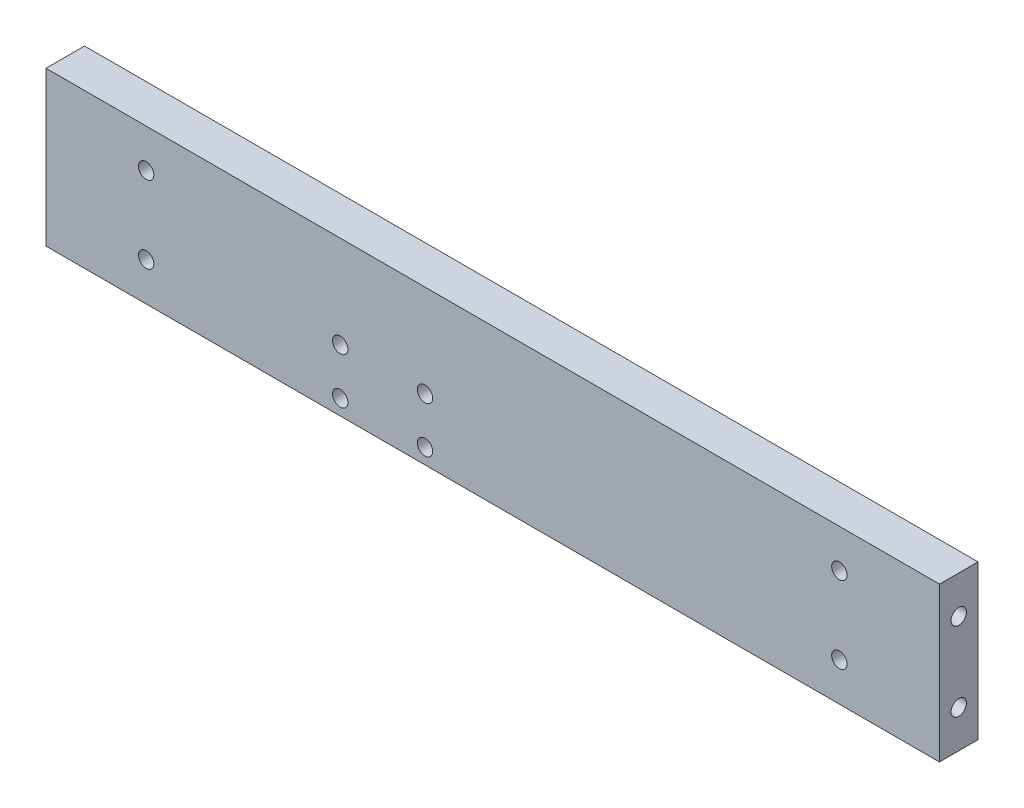
ISO-10303-21;
HEADER;
FILE_DESCRIPTION(('STEP AP214'),'2;1');
FILE_NAME('part.step','',(''),(''),'','','');
FILE_SCHEMA(('AUTOMOTIVE_DESIGN { 1 0 10303 214 1 1 1 1 }'));
ENDSEC;
DATA;
#1=APPLICATION_CONTEXT('core data for automotive mechanical design processes');
#2=APPLICATION_PROTOCOL_DEFINITION('international standard','automotive_design',2000,#1);
#3=PRODUCT_CONTEXT('',#1,'mechanical');
#4=PRODUCT('Part','Part','',(#3));
#5=PRODUCT_RELATED_PRODUCT_CATEGORY('part','',(#4));
#6=PRODUCT_DEFINITION_FORMATION('','',#4);
#7=PRODUCT_DEFINITION_CONTEXT('part definition',#1,'design');
#8=PRODUCT_DEFINITION('design','',#6,#7);
#9=PRODUCT_DEFINITION_SHAPE('','',#8);
#10=(LENGTH_UNIT() NAMED_UNIT(*) SI_UNIT(.MILLI.,.METRE.));
#11=(NAMED_UNIT(*) PLANE_ANGLE_UNIT() SI_UNIT($,.RADIAN.));
#12=(NAMED_UNIT(*) SI_UNIT($,.STERADIAN.) SOLID_ANGLE_UNIT());
#13=UNCERTAINTY_MEASURE_WITH_UNIT(LENGTH_MEASURE(1.E-05),#10,'distance_accuracy_value','');
#14=(GEOMETRIC_REPRESENTATION_CONTEXT(3) GLOBAL_UNCERTAINTY_ASSIGNED_CONTEXT((#13)) GLOBAL_UNIT_ASSIGNED_CONTEXT((#10,
#11,#12)) REPRESENTATION_CONTEXT('',''));
#15=CARTESIAN_POINT('',(0.,0.,0.));
#16=DIRECTION('',(0.,0.,1.));
#17=DIRECTION('',(1.,0.,0.));
#18=AXIS2_PLACEMENT_3D('',#15,#16,#17);
#19=CARTESIAN_POINT('',(0.,0.,5.));
#20=DIRECTION('',(0.,0.,1.));
#21=DIRECTION('',(1.,0.,0.));
#22=AXIS2_PLACEMENT_3D('',#19,#20,#21);
#23=PLANE('',#22);
#24=CARTESIAN_POINT('',(-19.8,-8.,5.));
#25=DIRECTION('',(0.,0.,1.));
#26=DIRECTION('',(1.,0.,0.));
#27=AXIS2_PLACEMENT_3D('',#24,#25,#26);
#28=CIRCLE('',#27,1.);
#29=CARTESIAN_POINT('',(-18.8,-8.,5.));
#30=VERTEX_POINT('',#29);
#31=EDGE_CURVE('E187',#30,#30,#28,.T.);
#32=ORIENTED_EDGE('',*,*,#31,.F.);
#33=EDGE_LOOP('',(#32));
#34=FACE_BOUND('',#33,.T.);
#35=CARTESIAN_POINT('',(-8.8,-2.,5.));
#36=DIRECTION('',(0.,0.,1.));
#37=DIRECTION('',(1.,0.,0.));
#38=AXIS2_PLACEMENT_3D('',#35,#36,#37);
#39=CIRCLE('',#38,1.);
#40=CARTESIAN_POINT('',(-7.79999999999999,-2.,5.));
#41=VERTEX_POINT('',#40);
#42=EDGE_CURVE('E161',#41,#41,#39,.T.);
#43=ORIENTED_EDGE('',*,*,#42,.F.);
#44=EDGE_LOOP('',(#43));
#45=FACE_BOUND('',#44,.T.);
#46=CARTESIAN_POINT('',(45.,-5.,5.));
#47=DIRECTION('',(0.,0.,1.));
#48=DIRECTION('',(1.,0.,0.));
#49=AXIS2_PLACEMENT_3D('',#46,#47,#48);
#50=CIRCLE('',#49,0.999999999999998);
#51=CARTESIAN_POINT('',(46.,-5.,5.));
#52=VERTEX_POINT('',#51);
#53=EDGE_CURVE('E170',#52,#52,#50,.T.);
#54=ORIENTED_EDGE('',*,*,#53,.F.);
#55=EDGE_LOOP('',(#54));
#56=FACE_BOUND('',#55,.T.);
#57=CARTESIAN_POINT('',(45.,5.,5.));
#58=DIRECTION('',(0.,0.,-1.));
#59=DIRECTION('',(-1.,0.,0.));
#60=AXIS2_PLACEMENT_3D('',#57,#58,#59);
#61=CIRCLE('',#60,0.999999999999998);
#62=CARTESIAN_POINT('',(44.,5.,5.));
#63=VERTEX_POINT('',#62);
#64=EDGE_CURVE('E149',#63,#63,#61,.T.);
#65=ORIENTED_EDGE('',*,*,#64,.T.);
#66=EDGE_LOOP('',(#65));
#67=FACE_BOUND('',#66,.T.);
#68=DIRECTION('',(0.,-1.,0.));
#69=VECTOR('',#68,1.);
#70=CARTESIAN_POINT('',(58.,0.,5.));
#71=LINE('',#70,#69);
#72=CARTESIAN_POINT('',(58.,10.,5.));
#73=VERTEX_POINT('',#72);
#74=CARTESIAN_POINT('',(58.,-10.,5.));
#75=VERTEX_POINT('',#74);
#76=EDGE_CURVE('E93',#73,#75,#71,.T.);
#77=ORIENTED_EDGE('',*,*,#76,.F.);
#78=DIRECTION('',(1.,0.,0.));
#79=VECTOR('',#78,1.);
#80=CARTESIAN_POINT('',(0.,10.,5.));
#81=LINE('',#80,#79);
#82=CARTESIAN_POINT('',(-58.,10.,5.));
#83=VERTEX_POINT('',#82);
#84=EDGE_CURVE('E84',#83,#73,#81,.T.);
#85=ORIENTED_EDGE('',*,*,#84,.F.);
#86=DIRECTION('',(0.,-1.,0.));
#87=VECTOR('',#86,1.);
#88=CARTESIAN_POINT('',(-58.,0.,5.));
#89=LINE('',#88,#87);
#90=CARTESIAN_POINT('',(-58.,-10.,5.));
#91=VERTEX_POINT('',#90);
#92=EDGE_CURVE('E88',#83,#91,#89,.T.);
#93=ORIENTED_EDGE('',*,*,#92,.T.);
#94=DIRECTION('',(1.,0.,0.));
#95=VECTOR('',#94,1.);
#96=CARTESIAN_POINT('',(0.,-10.,5.));
#97=LINE('',#96,#95);
#98=EDGE_CURVE('E51',#91,#75,#97,.T.);
#99=ORIENTED_EDGE('',*,*,#98,.T.);
#100=EDGE_LOOP('',(#77,#85,#93,#99));
#101=FACE_BOUND('',#100,.T.);
#102=CARTESIAN_POINT('',(-45.,-5.,5.));
#103=DIRECTION('',(0.,0.,-1.));
#104=DIRECTION('',(-1.,0.,0.));
#105=AXIS2_PLACEMENT_3D('',#102,#103,#104);
#106=CIRCLE('',#105,0.999999999999998);
#107=CARTESIAN_POINT('',(-46.,-5.,5.));
#108=VERTEX_POINT('',#107);
#109=EDGE_CURVE('E164',#108,#108,#106,.T.);
#110=ORIENTED_EDGE('',*,*,#109,.T.);
#111=EDGE_LOOP('',(#110));
#112=FACE_BOUND('',#111,.T.);
#113=CARTESIAN_POINT('',(-45.,5.,5.));
#114=DIRECTION('',(0.,0.,1.));
#115=DIRECTION('',(1.,0.,0.));
#116=AXIS2_PLACEMENT_3D('',#113,#114,#115);
#117=CIRCLE('',#116,0.999999999999998);
#118=CARTESIAN_POINT('',(-44.,5.,5.));
#119=VERTEX_POINT('',#118);
#120=EDGE_CURVE('E157',#119,#119,#117,.T.);
#121=ORIENTED_EDGE('',*,*,#120,.F.);
#122=EDGE_LOOP('',(#121));
#123=FACE_BOUND('',#122,.T.);
#124=CARTESIAN_POINT('',(-8.8,-8.,5.));
#125=DIRECTION('',(0.,0.,-1.));
#126=DIRECTION('',(-1.,0.,0.));
#127=AXIS2_PLACEMENT_3D('',#124,#125,#126);
#128=CIRCLE('',#127,1.);
#129=CARTESIAN_POINT('',(-9.8,-8.,5.));
#130=VERTEX_POINT('',#129);
#131=EDGE_CURVE('E193',#130,#130,#128,.T.);
#132=ORIENTED_EDGE('',*,*,#131,.T.);
#133=EDGE_LOOP('',(#132));
#134=FACE_BOUND('',#133,.T.);
#135=CARTESIAN_POINT('',(-19.8,-2.,5.));
#136=DIRECTION('',(0.,0.,-1.));
#137=DIRECTION('',(-1.,0.,0.));
#138=AXIS2_PLACEMENT_3D('',#135,#136,#137);
#139=CIRCLE('',#138,1.);
#140=CARTESIAN_POINT('',(-20.8,-2.,5.));
#141=VERTEX_POINT('',#140);
#142=EDGE_CURVE('E181',#141,#141,#139,.T.);
#143=ORIENTED_EDGE('',*,*,#142,.T.);
#144=EDGE_LOOP('',(#143));
#145=FACE_BOUND('',#144,.T.);
#146=ADVANCED_FACE('F34',(#34,#45,#56,#67,#101,#112,#123,#134,#145),#23,.T.);
#147=CARTESIAN_POINT('',(0.,0.,0.));
#148=DIRECTION('',(0.,0.,1.));
#149=DIRECTION('',(1.,0.,0.));
#150=AXIS2_PLACEMENT_3D('',#147,#148,#149);
#151=PLANE('',#150);
#152=CARTESIAN_POINT('',(-8.8,-8.,0.));
#153=DIRECTION('',(0.,0.,-1.));
#154=DIRECTION('',(-1.,0.,0.));
#155=AXIS2_PLACEMENT_3D('',#152,#153,#154);
#156=CIRCLE('',#155,1.);
#157=CARTESIAN_POINT('',(-9.8,-8.,0.));
#158=VERTEX_POINT('',#157);
#159=EDGE_CURVE('E178',#158,#158,#156,.T.);
#160=ORIENTED_EDGE('',*,*,#159,.F.);
#161=EDGE_LOOP('',(#160));
#162=FACE_BOUND('',#161,.T.);
#163=CARTESIAN_POINT('',(-8.8,-2.,0.));
#164=DIRECTION('',(0.,0.,1.));
#165=DIRECTION('',(1.,0.,0.));
#166=AXIS2_PLACEMENT_3D('',#163,#164,#165);
#167=CIRCLE('',#166,1.);
#168=CARTESIAN_POINT('',(-7.79999999999999,-2.,0.));
#169=VERTEX_POINT('',#168);
#170=EDGE_CURVE('E175',#169,#169,#167,.T.);
#171=ORIENTED_EDGE('',*,*,#170,.T.);
#172=EDGE_LOOP('',(#171));
#173=FACE_BOUND('',#172,.T.);
#174=CARTESIAN_POINT('',(-45.,-5.,0.));
#175=DIRECTION('',(0.,0.,-1.));
#176=DIRECTION('',(-1.,0.,0.));
#177=AXIS2_PLACEMENT_3D('',#174,#175,#176);
#178=CIRCLE('',#177,0.999999999999998);
#179=CARTESIAN_POINT('',(-46.,-5.,0.));
#180=VERTEX_POINT('',#179);
#181=EDGE_CURVE('E167',#180,#180,#178,.T.);
#182=ORIENTED_EDGE('',*,*,#181,.F.);
#183=EDGE_LOOP('',(#182));
#184=FACE_BOUND('',#183,.T.);
#185=CARTESIAN_POINT('',(45.,5.,0.));
#186=DIRECTION('',(0.,0.,-1.));
#187=DIRECTION('',(-1.,0.,0.));
#188=AXIS2_PLACEMENT_3D('',#185,#186,#187);
#189=CIRCLE('',#188,0.999999999999998);
#190=CARTESIAN_POINT('',(44.,5.,0.));
#191=VERTEX_POINT('',#190);
#192=EDGE_CURVE('E143',#191,#191,#189,.T.);
#193=ORIENTED_EDGE('',*,*,#192,.F.);
#194=EDGE_LOOP('',(#193));
#195=FACE_BOUND('',#194,.T.);
#196=DIRECTION('',(0.,-1.,0.));
#197=VECTOR('',#196,1.);
#198=CARTESIAN_POINT('',(58.,0.,0.));
#199=LINE('',#198,#197);
#200=CARTESIAN_POINT('',(58.,10.,0.));
#201=VERTEX_POINT('',#200);
#202=CARTESIAN_POINT('',(58.,-10.,0.));
#203=VERTEX_POINT('',#202);
#204=EDGE_CURVE('E100',#201,#203,#199,.T.);
#205=ORIENTED_EDGE('',*,*,#204,.T.);
#206=DIRECTION('',(1.,0.,0.));
#207=VECTOR('',#206,1.);
#208=CARTESIAN_POINT('',(0.,-10.,0.));
#209=LINE('',#208,#207);
#210=CARTESIAN_POINT('',(-58.,-10.,0.));
#211=VERTEX_POINT('',#210);
#212=EDGE_CURVE('E95',#211,#203,#209,.T.);
#213=ORIENTED_EDGE('',*,*,#212,.F.);
#214=DIRECTION('',(0.,-1.,0.));
#215=VECTOR('',#214,1.);
#216=CARTESIAN_POINT('',(-58.,0.,0.));
#217=LINE('',#216,#215);
#218=CARTESIAN_POINT('',(-58.,10.,0.));
#219=VERTEX_POINT('',#218);
#220=EDGE_CURVE('E66',#219,#211,#217,.T.);
#221=ORIENTED_EDGE('',*,*,#220,.F.);
#222=DIRECTION('',(1.,0.,0.));
#223=VECTOR('',#222,1.);
#224=CARTESIAN_POINT('',(0.,10.,0.));
#225=LINE('',#224,#223);
#226=EDGE_CURVE('E86',#219,#201,#225,.T.);
#227=ORIENTED_EDGE('',*,*,#226,.T.);
#228=EDGE_LOOP('',(#205,#213,#221,#227));
#229=FACE_BOUND('',#228,.T.);
#230=CARTESIAN_POINT('',(45.,-5.,0.));
#231=DIRECTION('',(0.,0.,1.));
#232=DIRECTION('',(1.,0.,0.));
#233=AXIS2_PLACEMENT_3D('',#230,#231,#232);
#234=CIRCLE('',#233,0.999999999999998);
#235=CARTESIAN_POINT('',(46.,-5.,0.));
#236=VERTEX_POINT('',#235);
#237=EDGE_CURVE('E155',#236,#236,#234,.T.);
#238=ORIENTED_EDGE('',*,*,#237,.T.);
#239=EDGE_LOOP('',(#238));
#240=FACE_BOUND('',#239,.T.);
#241=CARTESIAN_POINT('',(-45.,5.,0.));
#242=DIRECTION('',(0.,0.,1.));
#243=DIRECTION('',(1.,0.,0.));
#244=AXIS2_PLACEMENT_3D('',#241,#242,#243);
#245=CIRCLE('',#244,0.999999999999998);
#246=CARTESIAN_POINT('',(-44.,5.,0.));
#247=VERTEX_POINT('',#246);
#248=EDGE_CURVE('E160',#247,#247,#245,.T.);
#249=ORIENTED_EDGE('',*,*,#248,.T.);
#250=EDGE_LOOP('',(#249));
#251=FACE_BOUND('',#250,.T.);
#252=CARTESIAN_POINT('',(-19.8,-8.,0.));
#253=DIRECTION('',(0.,0.,1.));
#254=DIRECTION('',(1.,0.,0.));
#255=AXIS2_PLACEMENT_3D('',#252,#253,#254);
#256=CIRCLE('',#255,1.);
#257=CARTESIAN_POINT('',(-18.8,-8.,0.));
#258=VERTEX_POINT('',#257);
#259=EDGE_CURVE('E190',#258,#258,#256,.T.);
#260=ORIENTED_EDGE('',*,*,#259,.T.);
#261=EDGE_LOOP('',(#260));
#262=FACE_BOUND('',#261,.T.);
#263=CARTESIAN_POINT('',(-19.8,-2.,0.));
#264=DIRECTION('',(0.,0.,-1.));
#265=DIRECTION('',(-1.,0.,0.));
#266=AXIS2_PLACEMENT_3D('',#263,#264,#265);
#267=CIRCLE('',#266,1.);
#268=CARTESIAN_POINT('',(-20.8,-2.,0.));
#269=VERTEX_POINT('',#268);
#270=EDGE_CURVE('E184',#269,#269,#267,.T.);
#271=ORIENTED_EDGE('',*,*,#270,.F.);
#272=EDGE_LOOP('',(#271));
#273=FACE_BOUND('',#272,.T.);
#274=ADVANCED_FACE('F112',(#162,#173,#184,#195,#229,#240,#251,#262,#273),#151,.F.);
#275=CARTESIAN_POINT('',(-58.,0.,5.));
#276=DIRECTION('',(1.,0.,0.));
#277=DIRECTION('',(0.,0.,-1.));
#278=AXIS2_PLACEMENT_3D('',#275,#276,#277);
#279=PLANE('',#278);
#280=ORIENTED_EDGE('',*,*,#220,.T.);
#281=DIRECTION('',(0.,0.,-1.));
#282=VECTOR('',#281,1.);
#283=CARTESIAN_POINT('',(-58.,-10.,5.));
#284=LINE('',#283,#282);
#285=EDGE_CURVE('E87',#91,#211,#284,.T.);
#286=ORIENTED_EDGE('',*,*,#285,.F.);
#287=ORIENTED_EDGE('',*,*,#92,.F.);
#288=DIRECTION('',(0.,0.,-1.));
#289=VECTOR('',#288,1.);
#290=CARTESIAN_POINT('',(-58.,10.,5.));
#291=LINE('',#290,#289);
#292=EDGE_CURVE('E43',#83,#219,#291,.T.);
#293=ORIENTED_EDGE('',*,*,#292,.T.);
#294=EDGE_LOOP('',(#280,#286,#287,#293));
#295=FACE_BOUND('',#294,.T.);
#296=CARTESIAN_POINT('',(-58.,-5.,2.5));
#297=DIRECTION('',(-1.,0.,0.));
#298=DIRECTION('',(0.,0.,1.));
#299=AXIS2_PLACEMENT_3D('',#296,#297,#298);
#300=CIRCLE('',#299,1.);
#301=CARTESIAN_POINT('',(-58.,-5.,3.5));
#302=VERTEX_POINT('',#301);
#303=EDGE_CURVE('E147',#302,#302,#300,.F.);
#304=ORIENTED_EDGE('',*,*,#303,.T.);
#305=EDGE_LOOP('',(#304));
#306=FACE_BOUND('',#305,.T.);
#307=CARTESIAN_POINT('',(-58.,5.,2.5));
#308=DIRECTION('',(-1.,0.,0.));
#309=DIRECTION('',(0.,0.,1.));
#310=AXIS2_PLACEMENT_3D('',#307,#308,#309);
#311=CIRCLE('',#310,1.);
#312=CARTESIAN_POINT('',(-58.,5.,3.5));
#313=VERTEX_POINT('',#312);
#314=EDGE_CURVE('E135',#313,#313,#311,.T.);
#315=ORIENTED_EDGE('',*,*,#314,.F.);
#316=EDGE_LOOP('',(#315));
#317=FACE_BOUND('',#316,.T.);
#318=ADVANCED_FACE('F89',(#295,#306,#317),#279,.F.);
#319=CARTESIAN_POINT('',(58.,0.,5.));
#320=DIRECTION('',(1.,0.,0.));
#321=DIRECTION('',(0.,1.,0.));
#322=AXIS2_PLACEMENT_3D('',#319,#320,#321);
#323=PLANE('',#322);
#324=ORIENTED_EDGE('',*,*,#204,.F.);
#325=DIRECTION('',(0.,0.,-1.));
#326=VECTOR('',#325,1.);
#327=CARTESIAN_POINT('',(58.,10.,5.));
#328=LINE('',#327,#326);
#329=EDGE_CURVE('E11',#73,#201,#328,.T.);
#330=ORIENTED_EDGE('',*,*,#329,.F.);
#331=ORIENTED_EDGE('',*,*,#76,.T.);
#332=DIRECTION('',(0.,0.,-1.));
#333=VECTOR('',#332,1.);
#334=CARTESIAN_POINT('',(58.,-10.,5.));
#335=LINE('',#334,#333);
#336=EDGE_CURVE('E73',#75,#203,#335,.T.);
#337=ORIENTED_EDGE('',*,*,#336,.T.);
#338=EDGE_LOOP('',(#324,#330,#331,#337));
#339=FACE_BOUND('',#338,.T.);
#340=CARTESIAN_POINT('',(58.,5.11999999999998,2.5));
#341=DIRECTION('',(1.,0.,0.));
#342=DIRECTION('',(0.,0.,-1.));
#343=AXIS2_PLACEMENT_3D('',#340,#341,#342);
#344=CIRCLE('',#343,1.);
#345=CARTESIAN_POINT('',(58.,5.11999999999998,1.5));
#346=VERTEX_POINT('',#345);
#347=EDGE_CURVE('E119',#346,#346,#344,.T.);
#348=ORIENTED_EDGE('',*,*,#347,.F.);
#349=EDGE_LOOP('',(#348));
#350=FACE_BOUND('',#349,.T.);
#351=CARTESIAN_POINT('',(58.,-5.12000000000002,2.5));
#352=DIRECTION('',(1.,0.,0.));
#353=DIRECTION('',(0.,0.,-1.));
#354=AXIS2_PLACEMENT_3D('',#351,#352,#353);
#355=CIRCLE('',#354,1.);
#356=CARTESIAN_POINT('',(58.,-5.12000000000002,1.5));
#357=VERTEX_POINT('',#356);
#358=EDGE_CURVE('E122',#357,#357,#355,.F.);
#359=ORIENTED_EDGE('',*,*,#358,.T.);
#360=EDGE_LOOP('',(#359));
#361=FACE_BOUND('',#360,.T.);
#362=ADVANCED_FACE('F36',(#339,#350,#361),#323,.T.);
#363=CARTESIAN_POINT('',(0.,10.,5.));
#364=DIRECTION('',(0.,1.,0.));
#365=DIRECTION('',(0.,0.,1.));
#366=AXIS2_PLACEMENT_3D('',#363,#364,#365);
#367=PLANE('',#366);
#368=ORIENTED_EDGE('',*,*,#226,.F.);
#369=ORIENTED_EDGE('',*,*,#292,.F.);
#370=ORIENTED_EDGE('',*,*,#84,.T.);
#371=ORIENTED_EDGE('',*,*,#329,.T.);
#372=EDGE_LOOP('',(#368,#369,#370,#371));
#373=FACE_BOUND('',#372,.T.);
#374=ADVANCED_FACE('F82',(#373),#367,.T.);
#375=CARTESIAN_POINT('',(0.,-10.,5.));
#376=DIRECTION('',(0.,1.,0.));
#377=DIRECTION('',(0.,0.,1.));
#378=AXIS2_PLACEMENT_3D('',#375,#376,#377);
#379=PLANE('',#378);
#380=ORIENTED_EDGE('',*,*,#212,.T.);
#381=ORIENTED_EDGE('',*,*,#336,.F.);
#382=ORIENTED_EDGE('',*,*,#98,.F.);
#383=ORIENTED_EDGE('',*,*,#285,.T.);
#384=EDGE_LOOP('',(#380,#381,#382,#383));
#385=FACE_BOUND('',#384,.T.);
#386=ADVANCED_FACE('F110',(#385),#379,.F.);
#387=CARTESIAN_POINT('',(48.,5.11999999999998,2.5));
#388=DIRECTION('',(1.,0.,0.));
#389=DIRECTION('',(0.,0.,-1.));
#390=AXIS2_PLACEMENT_3D('',#387,#388,#389);
#391=CYLINDRICAL_SURFACE('',#390,1.);
#392=CARTESIAN_POINT('',(48.,5.11999999999998,2.5));
#393=DIRECTION('',(1.,0.,0.));
#394=DIRECTION('',(0.,0.,-1.));
#395=AXIS2_PLACEMENT_3D('',#392,#393,#394);
#396=CIRCLE('',#395,1.);
#397=CARTESIAN_POINT('',(48.,5.11999999999998,1.5));
#398=VERTEX_POINT('',#397);
#399=EDGE_CURVE('E127',#398,#398,#396,.T.);
#400=ORIENTED_EDGE('',*,*,#399,.F.);
#401=EDGE_LOOP('',(#400));
#402=FACE_BOUND('',#401,.T.);
#403=ORIENTED_EDGE('',*,*,#347,.T.);
#404=EDGE_LOOP('',(#403));
#405=FACE_BOUND('',#404,.T.);
#406=ADVANCED_FACE('F239',(#402,#405),#391,.F.);
#407=CARTESIAN_POINT('',(48.,5.11999999999998,2.5));
#408=DIRECTION('',(1.,0.,0.));
#409=DIRECTION('',(0.,0.,-1.));
#410=AXIS2_PLACEMENT_3D('',#407,#408,#409);
#411=PLANE('',#410);
#412=ORIENTED_EDGE('',*,*,#399,.T.);
#413=EDGE_LOOP('',(#412));
#414=FACE_BOUND('',#413,.T.);
#415=ADVANCED_FACE('F234',(#414),#411,.T.);
#416=CARTESIAN_POINT('',(48.,-5.12000000000002,2.5));
#417=DIRECTION('',(1.,0.,0.));
#418=DIRECTION('',(0.,0.,-1.));
#419=AXIS2_PLACEMENT_3D('',#416,#417,#418);
#420=CYLINDRICAL_SURFACE('',#419,1.);
#421=CARTESIAN_POINT('',(48.,-5.12000000000002,2.5));
#422=DIRECTION('',(1.,0.,0.));
#423=DIRECTION('',(0.,0.,-1.));
#424=AXIS2_PLACEMENT_3D('',#421,#422,#423);
#425=CIRCLE('',#424,1.);
#426=CARTESIAN_POINT('',(48.,-5.12000000000002,1.5));
#427=VERTEX_POINT('',#426);
#428=EDGE_CURVE('E103',#427,#427,#425,.F.);
#429=ORIENTED_EDGE('',*,*,#428,.T.);
#430=EDGE_LOOP('',(#429));
#431=FACE_BOUND('',#430,.T.);
#432=ORIENTED_EDGE('',*,*,#358,.F.);
#433=EDGE_LOOP('',(#432));
#434=FACE_BOUND('',#433,.T.);
#435=ADVANCED_FACE('F262',(#431,#434),#420,.F.);
#436=CARTESIAN_POINT('',(48.,0.,0.));
#437=DIRECTION('',(1.,0.,0.));
#438=DIRECTION('',(0.,0.,-1.));
#439=AXIS2_PLACEMENT_3D('',#436,#437,#438);
#440=PLANE('',#439);
#441=ORIENTED_EDGE('',*,*,#428,.F.);
#442=EDGE_LOOP('',(#441));
#443=FACE_BOUND('',#442,.T.);
#444=ADVANCED_FACE('F268',(#443),#440,.T.);
#445=CARTESIAN_POINT('',(-53.,-5.,2.5));
#446=DIRECTION('',(-1.,0.,0.));
#447=DIRECTION('',(0.,-1.,0.));
#448=AXIS2_PLACEMENT_3D('',#445,#446,#447);
#449=CYLINDRICAL_SURFACE('',#448,1.);
#450=CARTESIAN_POINT('',(-53.,-5.,2.5));
#451=DIRECTION('',(-1.,0.,0.));
#452=DIRECTION('',(0.,0.,1.));
#453=AXIS2_PLACEMENT_3D('',#450,#451,#452);
#454=CIRCLE('',#453,1.);
#455=CARTESIAN_POINT('',(-53.,-5.,3.5));
#456=VERTEX_POINT('',#455);
#457=EDGE_CURVE('E140',#456,#456,#454,.F.);
#458=ORIENTED_EDGE('',*,*,#457,.T.);
#459=EDGE_LOOP('',(#458));
#460=FACE_BOUND('',#459,.T.);
#461=ORIENTED_EDGE('',*,*,#303,.F.);
#462=EDGE_LOOP('',(#461));
#463=FACE_BOUND('',#462,.T.);
#464=ADVANCED_FACE('F276',(#460,#463),#449,.F.);
#465=CARTESIAN_POINT('',(-53.,0.,0.));
#466=DIRECTION('',(-1.,0.,0.));
#467=DIRECTION('',(0.,0.,1.));
#468=AXIS2_PLACEMENT_3D('',#465,#466,#467);
#469=PLANE('',#468);
#470=ORIENTED_EDGE('',*,*,#457,.F.);
#471=EDGE_LOOP('',(#470));
#472=FACE_BOUND('',#471,.T.);
#473=ADVANCED_FACE('F285',(#472),#469,.T.);
#474=CARTESIAN_POINT('',(-53.,5.,2.5));
#475=DIRECTION('',(-1.,0.,0.));
#476=DIRECTION('',(0.,-1.,0.));
#477=AXIS2_PLACEMENT_3D('',#474,#475,#476);
#478=CYLINDRICAL_SURFACE('',#477,1.);
#479=CARTESIAN_POINT('',(-53.,5.,2.5));
#480=DIRECTION('',(-1.,0.,0.));
#481=DIRECTION('',(0.,0.,1.));
#482=AXIS2_PLACEMENT_3D('',#479,#480,#481);
#483=CIRCLE('',#482,1.);
#484=CARTESIAN_POINT('',(-53.,5.,3.5));
#485=VERTEX_POINT('',#484);
#486=EDGE_CURVE('E131',#485,#485,#483,.T.);
#487=ORIENTED_EDGE('',*,*,#486,.F.);
#488=EDGE_LOOP('',(#487));
#489=FACE_BOUND('',#488,.T.);
#490=ORIENTED_EDGE('',*,*,#314,.T.);
#491=EDGE_LOOP('',(#490));
#492=FACE_BOUND('',#491,.T.);
#493=ADVANCED_FACE('F223',(#489,#492),#478,.F.);
#494=CARTESIAN_POINT('',(-53.,0.,0.));
#495=DIRECTION('',(-1.,0.,0.));
#496=DIRECTION('',(0.,0.,1.));
#497=AXIS2_PLACEMENT_3D('',#494,#495,#496);
#498=PLANE('',#497);
#499=ORIENTED_EDGE('',*,*,#486,.T.);
#500=EDGE_LOOP('',(#499));
#501=FACE_BOUND('',#500,.T.);
#502=ADVANCED_FACE('F213',(#501),#498,.T.);
#503=CARTESIAN_POINT('',(45.,5.,5.));
#504=DIRECTION('',(0.,0.,-1.));
#505=DIRECTION('',(-1.,0.,0.));
#506=AXIS2_PLACEMENT_3D('',#503,#504,#505);
#507=CYLINDRICAL_SURFACE('',#506,0.999999999999998);
#508=ORIENTED_EDGE('',*,*,#64,.F.);
#509=EDGE_LOOP('',(#508));
#510=FACE_BOUND('',#509,.T.);
#511=ORIENTED_EDGE('',*,*,#192,.T.);
#512=EDGE_LOOP('',(#511));
#513=FACE_BOUND('',#512,.T.);
#514=ADVANCED_FACE('F210',(#510,#513),#507,.F.);
#515=CARTESIAN_POINT('',(45.,-5.,5.));
#516=DIRECTION('',(0.,0.,-1.));
#517=DIRECTION('',(-1.,0.,0.));
#518=AXIS2_PLACEMENT_3D('',#515,#516,#517);
#519=CYLINDRICAL_SURFACE('',#518,0.999999999999998);
#520=ORIENTED_EDGE('',*,*,#53,.T.);
#521=EDGE_LOOP('',(#520));
#522=FACE_BOUND('',#521,.T.);
#523=ORIENTED_EDGE('',*,*,#237,.F.);
#524=EDGE_LOOP('',(#523));
#525=FACE_BOUND('',#524,.T.);
#526=ADVANCED_FACE('F212',(#522,#525),#519,.F.);
#527=CARTESIAN_POINT('',(-45.,-5.,5.));
#528=DIRECTION('',(0.,0.,-1.));
#529=DIRECTION('',(-1.,0.,0.));
#530=AXIS2_PLACEMENT_3D('',#527,#528,#529);
#531=CYLINDRICAL_SURFACE('',#530,0.999999999999998);
#532=ORIENTED_EDGE('',*,*,#109,.F.);
#533=EDGE_LOOP('',(#532));
#534=FACE_BOUND('',#533,.T.);
#535=ORIENTED_EDGE('',*,*,#181,.T.);
#536=EDGE_LOOP('',(#535));
#537=FACE_BOUND('',#536,.T.);
#538=ADVANCED_FACE('F220',(#534,#537),#531,.F.);
#539=CARTESIAN_POINT('',(-45.,5.,5.));
#540=DIRECTION('',(0.,0.,-1.));
#541=DIRECTION('',(-1.,0.,0.));
#542=AXIS2_PLACEMENT_3D('',#539,#540,#541);
#543=CYLINDRICAL_SURFACE('',#542,0.999999999999998);
#544=ORIENTED_EDGE('',*,*,#120,.T.);
#545=EDGE_LOOP('',(#544));
#546=FACE_BOUND('',#545,.T.);
#547=ORIENTED_EDGE('',*,*,#248,.F.);
#548=EDGE_LOOP('',(#547));
#549=FACE_BOUND('',#548,.T.);
#550=ADVANCED_FACE('F324',(#546,#549),#543,.F.);
#551=CARTESIAN_POINT('',(-8.8,-2.,5.));
#552=DIRECTION('',(0.,0.,-1.));
#553=DIRECTION('',(-1.,0.,0.));
#554=AXIS2_PLACEMENT_3D('',#551,#552,#553);
#555=CYLINDRICAL_SURFACE('',#554,1.);
#556=ORIENTED_EDGE('',*,*,#42,.T.);
#557=EDGE_LOOP('',(#556));
#558=FACE_BOUND('',#557,.T.);
#559=ORIENTED_EDGE('',*,*,#170,.F.);
#560=EDGE_LOOP('',(#559));
#561=FACE_BOUND('',#560,.T.);
#562=ADVANCED_FACE('F333',(#558,#561),#555,.F.);
#563=CARTESIAN_POINT('',(-8.8,-8.,5.));
#564=DIRECTION('',(0.,0.,-1.));
#565=DIRECTION('',(-1.,0.,0.));
#566=AXIS2_PLACEMENT_3D('',#563,#564,#565);
#567=CYLINDRICAL_SURFACE('',#566,1.);
#568=ORIENTED_EDGE('',*,*,#131,.F.);
#569=EDGE_LOOP('',(#568));
#570=FACE_BOUND('',#569,.T.);
#571=ORIENTED_EDGE('',*,*,#159,.T.);
#572=EDGE_LOOP('',(#571));
#573=FACE_BOUND('',#572,.T.);
#574=ADVANCED_FACE('F199',(#570,#573),#567,.F.);
#575=CARTESIAN_POINT('',(-19.8,-8.,5.));
#576=DIRECTION('',(0.,0.,-1.));
#577=DIRECTION('',(-1.,0.,0.));
#578=AXIS2_PLACEMENT_3D('',#575,#576,#577);
#579=CYLINDRICAL_SURFACE('',#578,1.);
#580=ORIENTED_EDGE('',*,*,#31,.T.);
#581=EDGE_LOOP('',(#580));
#582=FACE_BOUND('',#581,.T.);
#583=ORIENTED_EDGE('',*,*,#259,.F.);
#584=EDGE_LOOP('',(#583));
#585=FACE_BOUND('',#584,.T.);
#586=ADVANCED_FACE('F362',(#582,#585),#579,.F.);
#587=CARTESIAN_POINT('',(-19.8,-2.,5.));
#588=DIRECTION('',(0.,0.,-1.));
#589=DIRECTION('',(-1.,0.,0.));
#590=AXIS2_PLACEMENT_3D('',#587,#588,#589);
#591=CYLINDRICAL_SURFACE('',#590,1.);
#592=ORIENTED_EDGE('',*,*,#142,.F.);
#593=EDGE_LOOP('',(#592));
#594=FACE_BOUND('',#593,.T.);
#595=ORIENTED_EDGE('',*,*,#270,.T.);
#596=EDGE_LOOP('',(#595));
#597=FACE_BOUND('',#596,.T.);
#598=ADVANCED_FACE('F372',(#594,#597),#591,.F.);
#599=CLOSED_SHELL('',(#146,#274,#318,#362,#374,#386,#406,#415,#435,#444,#464,#473,#493,#502,
#514,#526,#538,#550,#562,#574,#586,#598));
#600=MANIFOLD_SOLID_BREP('B2',#599);
#601=ADVANCED_BREP_SHAPE_REPRESENTATION('',(#18,#600),#14);
#602=SHAPE_DEFINITION_REPRESENTATION(#9,#601);
ENDSEC;
END-ISO-10303-21;
